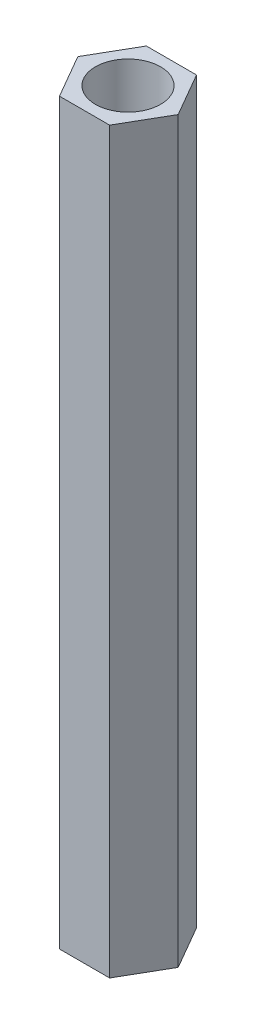
ISO-10303-21;
HEADER;
FILE_DESCRIPTION(('STEP AP214'),'2;1');
FILE_NAME('part.step','',(''),(''),'','','');
FILE_SCHEMA(('AUTOMOTIVE_DESIGN { 1 0 10303 214 1 1 1 1 }'));
ENDSEC;
DATA;
#1=APPLICATION_CONTEXT('core data for automotive mechanical design processes');
#2=APPLICATION_PROTOCOL_DEFINITION('international standard','automotive_design',2000,#1);
#3=PRODUCT_CONTEXT('',#1,'mechanical');
#4=PRODUCT('Part','Part','',(#3));
#5=PRODUCT_RELATED_PRODUCT_CATEGORY('part','',(#4));
#6=PRODUCT_DEFINITION_FORMATION('','',#4);
#7=PRODUCT_DEFINITION_CONTEXT('part definition',#1,'design');
#8=PRODUCT_DEFINITION('design','',#6,#7);
#9=PRODUCT_DEFINITION_SHAPE('','',#8);
#10=(LENGTH_UNIT() NAMED_UNIT(*) SI_UNIT(.MILLI.,.METRE.));
#11=(NAMED_UNIT(*) PLANE_ANGLE_UNIT() SI_UNIT($,.RADIAN.));
#12=(NAMED_UNIT(*) SI_UNIT($,.STERADIAN.) SOLID_ANGLE_UNIT());
#13=UNCERTAINTY_MEASURE_WITH_UNIT(LENGTH_MEASURE(1.E-05),#10,'distance_accuracy_value','');
#14=(GEOMETRIC_REPRESENTATION_CONTEXT(3) GLOBAL_UNCERTAINTY_ASSIGNED_CONTEXT((#13)) GLOBAL_UNIT_ASSIGNED_CONTEXT((#10,
#11,#12)) REPRESENTATION_CONTEXT('',''));
#15=CARTESIAN_POINT('',(0.,0.,0.));
#16=DIRECTION('',(0.,0.,1.));
#17=DIRECTION('',(1.,0.,0.));
#18=AXIS2_PLACEMENT_3D('',#15,#16,#17);
#19=CARTESIAN_POINT('',(0.,17.,0.));
#20=DIRECTION('',(0.,1.,0.));
#21=DIRECTION('',(0.,0.,1.));
#22=AXIS2_PLACEMENT_3D('',#19,#20,#21);
#23=PLANE('',#22);
#24=DIRECTION('',(-0.5,0.,-0.866025403784438));
#25=VECTOR('',#24,1.);
#26=CARTESIAN_POINT('',(2.3094010767585,17.,0.));
#27=LINE('',#26,#25);
#28=CARTESIAN_POINT('',(2.3094010767585,17.,0.));
#29=VERTEX_POINT('',#28);
#30=CARTESIAN_POINT('',(1.15470053837925,17.,-2.));
#31=VERTEX_POINT('',#30);
#32=EDGE_CURVE('E130',#29,#31,#27,.T.);
#33=ORIENTED_EDGE('',*,*,#32,.T.);
#34=DIRECTION('',(-1.,0.,0.));
#35=VECTOR('',#34,1.);
#36=CARTESIAN_POINT('',(1.15470053837925,17.,-2.));
#37=LINE('',#36,#35);
#38=CARTESIAN_POINT('',(-1.15470053837925,17.,-2.));
#39=VERTEX_POINT('',#38);
#40=EDGE_CURVE('E88',#31,#39,#37,.T.);
#41=ORIENTED_EDGE('',*,*,#40,.T.);
#42=DIRECTION('',(-0.5,0.,0.866025403784439));
#43=VECTOR('',#42,1.);
#44=CARTESIAN_POINT('',(-1.15470053837925,17.,-2.));
#45=LINE('',#44,#43);
#46=CARTESIAN_POINT('',(-2.3094010767585,17.,0.));
#47=VERTEX_POINT('',#46);
#48=EDGE_CURVE('E101',#39,#47,#45,.T.);
#49=ORIENTED_EDGE('',*,*,#48,.T.);
#50=DIRECTION('',(0.5,0.,0.866025403784438));
#51=VECTOR('',#50,1.);
#52=CARTESIAN_POINT('',(-2.3094010767585,17.,0.));
#53=LINE('',#52,#51);
#54=CARTESIAN_POINT('',(-1.15470053837925,17.,2.));
#55=VERTEX_POINT('',#54);
#56=EDGE_CURVE('E95',#47,#55,#53,.T.);
#57=ORIENTED_EDGE('',*,*,#56,.T.);
#58=DIRECTION('',(1.,0.,0.));
#59=VECTOR('',#58,1.);
#60=CARTESIAN_POINT('',(-1.15470053837925,17.,2.));
#61=LINE('',#60,#59);
#62=CARTESIAN_POINT('',(1.15470053837925,17.,2.));
#63=VERTEX_POINT('',#62);
#64=EDGE_CURVE('E99',#55,#63,#61,.T.);
#65=ORIENTED_EDGE('',*,*,#64,.T.);
#66=DIRECTION('',(0.5,0.,-0.866025403784439));
#67=VECTOR('',#66,1.);
#68=CARTESIAN_POINT('',(1.15470053837925,17.,2.));
#69=LINE('',#68,#67);
#70=EDGE_CURVE('E51',#63,#29,#69,.T.);
#71=ORIENTED_EDGE('',*,*,#70,.T.);
#72=EDGE_LOOP('',(#33,#41,#49,#57,#65,#71));
#73=FACE_BOUND('',#72,.T.);
#74=CARTESIAN_POINT('',(0.,17.,0.));
#75=DIRECTION('',(0.,1.,0.));
#76=DIRECTION('',(0.,0.,1.));
#77=AXIS2_PLACEMENT_3D('',#74,#75,#76);
#78=CIRCLE('',#77,1.5);
#79=CARTESIAN_POINT('',(0.,17.,1.5));
#80=VERTEX_POINT('',#79);
#81=EDGE_CURVE('E123',#80,#80,#78,.T.);
#82=ORIENTED_EDGE('',*,*,#81,.F.);
#83=EDGE_LOOP('',(#82));
#84=FACE_BOUND('',#83,.T.);
#85=ADVANCED_FACE('F34',(#73,#84),#23,.T.);
#86=CARTESIAN_POINT('',(0.,-17.,0.));
#87=DIRECTION('',(0.,1.,0.));
#88=DIRECTION('',(0.,0.,1.));
#89=AXIS2_PLACEMENT_3D('',#86,#87,#88);
#90=PLANE('',#89);
#91=DIRECTION('',(-0.5,0.,-0.866025403784438));
#92=VECTOR('',#91,1.);
#93=CARTESIAN_POINT('',(2.3094010767585,-17.,0.));
#94=LINE('',#93,#92);
#95=CARTESIAN_POINT('',(2.3094010767585,-17.,0.));
#96=VERTEX_POINT('',#95);
#97=CARTESIAN_POINT('',(1.15470053837925,-17.,-2.));
#98=VERTEX_POINT('',#97);
#99=EDGE_CURVE('E119',#96,#98,#94,.T.);
#100=ORIENTED_EDGE('',*,*,#99,.F.);
#101=DIRECTION('',(0.5,0.,-0.866025403784439));
#102=VECTOR('',#101,1.);
#103=CARTESIAN_POINT('',(1.15470053837925,-17.,2.));
#104=LINE('',#103,#102);
#105=CARTESIAN_POINT('',(1.15470053837925,-17.,2.));
#106=VERTEX_POINT('',#105);
#107=EDGE_CURVE('E80',#106,#96,#104,.T.);
#108=ORIENTED_EDGE('',*,*,#107,.F.);
#109=DIRECTION('',(1.,0.,0.));
#110=VECTOR('',#109,1.);
#111=CARTESIAN_POINT('',(-1.15470053837925,-17.,2.));
#112=LINE('',#111,#110);
#113=CARTESIAN_POINT('',(-1.15470053837925,-17.,2.));
#114=VERTEX_POINT('',#113);
#115=EDGE_CURVE('E74',#114,#106,#112,.T.);
#116=ORIENTED_EDGE('',*,*,#115,.F.);
#117=DIRECTION('',(0.5,0.,0.866025403784438));
#118=VECTOR('',#117,1.);
#119=CARTESIAN_POINT('',(-2.3094010767585,-17.,0.));
#120=LINE('',#119,#118);
#121=CARTESIAN_POINT('',(-2.3094010767585,-17.,0.));
#122=VERTEX_POINT('',#121);
#123=EDGE_CURVE('E109',#122,#114,#120,.T.);
#124=ORIENTED_EDGE('',*,*,#123,.F.);
#125=DIRECTION('',(-0.5,0.,0.866025403784439));
#126=VECTOR('',#125,1.);
#127=CARTESIAN_POINT('',(-1.15470053837925,-17.,-2.));
#128=LINE('',#127,#126);
#129=CARTESIAN_POINT('',(-1.15470053837925,-17.,-2.));
#130=VERTEX_POINT('',#129);
#131=EDGE_CURVE('E125',#130,#122,#128,.T.);
#132=ORIENTED_EDGE('',*,*,#131,.F.);
#133=DIRECTION('',(-1.,0.,0.));
#134=VECTOR('',#133,1.);
#135=CARTESIAN_POINT('',(1.15470053837925,-17.,-2.));
#136=LINE('',#135,#134);
#137=EDGE_CURVE('E122',#98,#130,#136,.T.);
#138=ORIENTED_EDGE('',*,*,#137,.F.);
#139=EDGE_LOOP('',(#100,#108,#116,#124,#132,#138));
#140=FACE_BOUND('',#139,.T.);
#141=CARTESIAN_POINT('',(0.,-17.,0.));
#142=DIRECTION('',(0.,1.,0.));
#143=DIRECTION('',(0.,0.,1.));
#144=AXIS2_PLACEMENT_3D('',#141,#142,#143);
#145=CIRCLE('',#144,1.5);
#146=CARTESIAN_POINT('',(0.,-17.,1.5));
#147=VERTEX_POINT('',#146);
#148=EDGE_CURVE('E223',#147,#147,#145,.T.);
#149=ORIENTED_EDGE('',*,*,#148,.T.);
#150=EDGE_LOOP('',(#149));
#151=FACE_BOUND('',#150,.T.);
#152=ADVANCED_FACE('F139',(#140,#151),#90,.F.);
#153=CARTESIAN_POINT('',(2.3094010767585,17.,0.));
#154=DIRECTION('',(-0.866025403784439,0.,0.5));
#155=DIRECTION('',(0.5,0.,0.866025403784438));
#156=AXIS2_PLACEMENT_3D('',#153,#154,#155);
#157=PLANE('',#156);
#158=ORIENTED_EDGE('',*,*,#99,.T.);
#159=DIRECTION('',(0.,-1.,0.));
#160=VECTOR('',#159,1.);
#161=CARTESIAN_POINT('',(1.15470053837925,17.,-2.));
#162=LINE('',#161,#160);
#163=EDGE_CURVE('E11',#31,#98,#162,.T.);
#164=ORIENTED_EDGE('',*,*,#163,.F.);
#165=ORIENTED_EDGE('',*,*,#32,.F.);
#166=DIRECTION('',(0.,-1.,0.));
#167=VECTOR('',#166,1.);
#168=CARTESIAN_POINT('',(2.3094010767585,17.,0.));
#169=LINE('',#168,#167);
#170=EDGE_CURVE('E115',#29,#96,#169,.T.);
#171=ORIENTED_EDGE('',*,*,#170,.T.);
#172=EDGE_LOOP('',(#158,#164,#165,#171));
#173=FACE_BOUND('',#172,.T.);
#174=ADVANCED_FACE('F36',(#173),#157,.F.);
#175=CARTESIAN_POINT('',(1.15470053837925,17.,-2.));
#176=DIRECTION('',(0.,0.,1.));
#177=DIRECTION('',(1.,0.,0.));
#178=AXIS2_PLACEMENT_3D('',#175,#176,#177);
#179=PLANE('',#178);
#180=ORIENTED_EDGE('',*,*,#137,.T.);
#181=DIRECTION('',(0.,-1.,0.));
#182=VECTOR('',#181,1.);
#183=CARTESIAN_POINT('',(-1.15470053837925,17.,-2.));
#184=LINE('',#183,#182);
#185=EDGE_CURVE('E43',#39,#130,#184,.T.);
#186=ORIENTED_EDGE('',*,*,#185,.F.);
#187=ORIENTED_EDGE('',*,*,#40,.F.);
#188=ORIENTED_EDGE('',*,*,#163,.T.);
#189=EDGE_LOOP('',(#180,#186,#187,#188));
#190=FACE_BOUND('',#189,.T.);
#191=ADVANCED_FACE('F164',(#190),#179,.F.);
#192=CARTESIAN_POINT('',(-1.15470053837925,17.,-2.));
#193=DIRECTION('',(0.866025403784439,0.,0.5));
#194=DIRECTION('',(0.5,0.,-0.866025403784439));
#195=AXIS2_PLACEMENT_3D('',#192,#193,#194);
#196=PLANE('',#195);
#197=ORIENTED_EDGE('',*,*,#131,.T.);
#198=DIRECTION('',(0.,-1.,0.));
#199=VECTOR('',#198,1.);
#200=CARTESIAN_POINT('',(-2.3094010767585,17.,0.));
#201=LINE('',#200,#199);
#202=EDGE_CURVE('E110',#47,#122,#201,.T.);
#203=ORIENTED_EDGE('',*,*,#202,.F.);
#204=ORIENTED_EDGE('',*,*,#48,.F.);
#205=ORIENTED_EDGE('',*,*,#185,.T.);
#206=EDGE_LOOP('',(#197,#203,#204,#205));
#207=FACE_BOUND('',#206,.T.);
#208=ADVANCED_FACE('F136',(#207),#196,.F.);
#209=CARTESIAN_POINT('',(-2.3094010767585,17.,0.));
#210=DIRECTION('',(0.866025403784438,0.,-0.5));
#211=DIRECTION('',(-0.5,0.,-0.866025403784438));
#212=AXIS2_PLACEMENT_3D('',#209,#210,#211);
#213=PLANE('',#212);
#214=ORIENTED_EDGE('',*,*,#123,.T.);
#215=DIRECTION('',(0.,-1.,0.));
#216=VECTOR('',#215,1.);
#217=CARTESIAN_POINT('',(-1.15470053837925,17.,2.));
#218=LINE('',#217,#216);
#219=EDGE_CURVE('E106',#55,#114,#218,.T.);
#220=ORIENTED_EDGE('',*,*,#219,.F.);
#221=ORIENTED_EDGE('',*,*,#56,.F.);
#222=ORIENTED_EDGE('',*,*,#202,.T.);
#223=EDGE_LOOP('',(#214,#220,#221,#222));
#224=FACE_BOUND('',#223,.T.);
#225=ADVANCED_FACE('F107',(#224),#213,.F.);
#226=CARTESIAN_POINT('',(-1.15470053837925,17.,2.));
#227=DIRECTION('',(0.,0.,-1.));
#228=DIRECTION('',(-1.,0.,0.));
#229=AXIS2_PLACEMENT_3D('',#226,#227,#228);
#230=PLANE('',#229);
#231=ORIENTED_EDGE('',*,*,#115,.T.);
#232=DIRECTION('',(0.,-1.,0.));
#233=VECTOR('',#232,1.);
#234=CARTESIAN_POINT('',(1.15470053837925,17.,2.));
#235=LINE('',#234,#233);
#236=EDGE_CURVE('E111',#63,#106,#235,.T.);
#237=ORIENTED_EDGE('',*,*,#236,.F.);
#238=ORIENTED_EDGE('',*,*,#64,.F.);
#239=ORIENTED_EDGE('',*,*,#219,.T.);
#240=EDGE_LOOP('',(#231,#237,#238,#239));
#241=FACE_BOUND('',#240,.T.);
#242=ADVANCED_FACE('F113',(#241),#230,.F.);
#243=CARTESIAN_POINT('',(1.15470053837925,17.,2.));
#244=DIRECTION('',(-0.866025403784439,0.,-0.5));
#245=DIRECTION('',(-0.5,0.,0.866025403784439));
#246=AXIS2_PLACEMENT_3D('',#243,#244,#245);
#247=PLANE('',#246);
#248=ORIENTED_EDGE('',*,*,#107,.T.);
#249=ORIENTED_EDGE('',*,*,#170,.F.);
#250=ORIENTED_EDGE('',*,*,#70,.F.);
#251=ORIENTED_EDGE('',*,*,#236,.T.);
#252=EDGE_LOOP('',(#248,#249,#250,#251));
#253=FACE_BOUND('',#252,.T.);
#254=ADVANCED_FACE('F144',(#253),#247,.F.);
#255=CARTESIAN_POINT('',(0.,17.,0.));
#256=DIRECTION('',(0.,-1.,0.));
#257=DIRECTION('',(0.,0.,-1.));
#258=AXIS2_PLACEMENT_3D('',#255,#256,#257);
#259=CYLINDRICAL_SURFACE('',#258,1.5);
#260=ORIENTED_EDGE('',*,*,#81,.T.);
#261=EDGE_LOOP('',(#260));
#262=FACE_BOUND('',#261,.T.);
#263=ORIENTED_EDGE('',*,*,#148,.F.);
#264=EDGE_LOOP('',(#263));
#265=FACE_BOUND('',#264,.T.);
#266=ADVANCED_FACE('F146',(#262,#265),#259,.F.);
#267=CLOSED_SHELL('',(#85,#152,#174,#191,#208,#225,#242,#254,#266));
#268=MANIFOLD_SOLID_BREP('B2',#267);
#269=ADVANCED_BREP_SHAPE_REPRESENTATION('',(#18,#268),#14);
#270=SHAPE_DEFINITION_REPRESENTATION(#9,#269);
ENDSEC;
END-ISO-10303-21;
